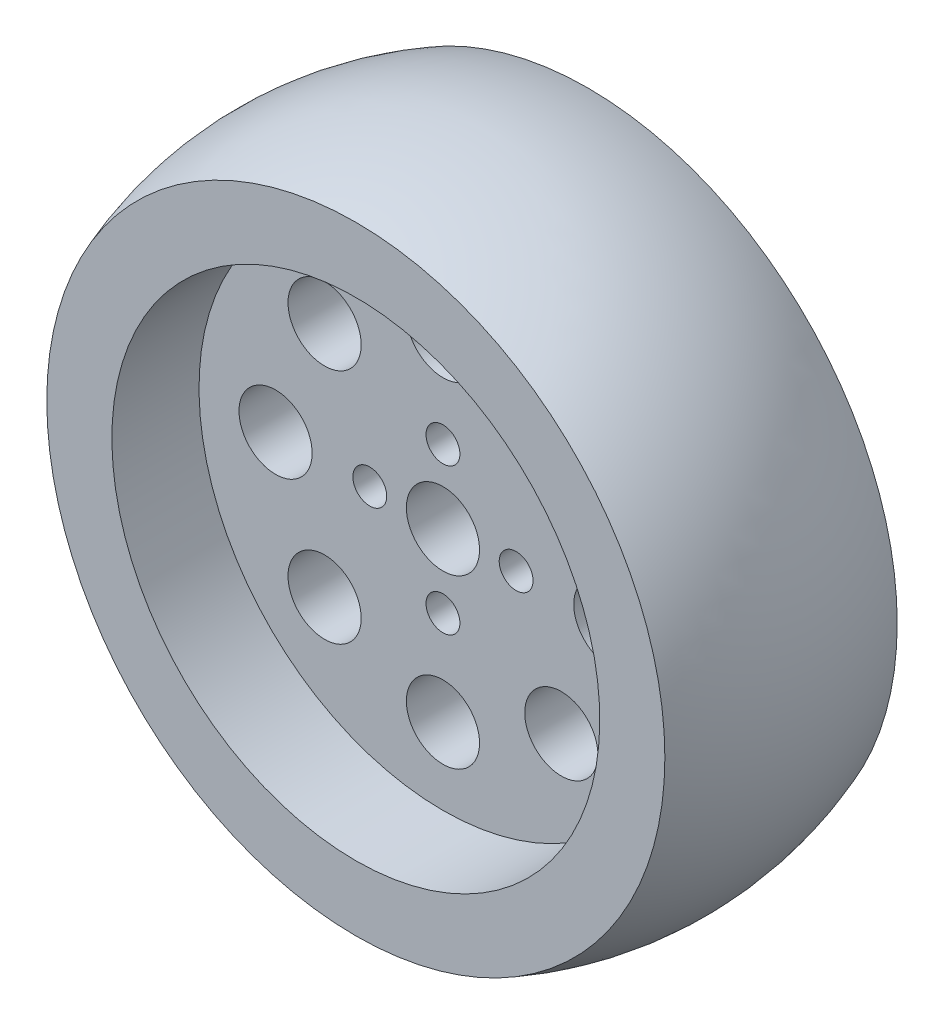
ISO-10303-21;
HEADER;
FILE_DESCRIPTION(('STEP AP214'),'2;1');
FILE_NAME('part.step','',(''),(''),'','','');
FILE_SCHEMA(('AUTOMOTIVE_DESIGN { 1 0 10303 214 1 1 1 1 }'));
ENDSEC;
DATA;
#1=APPLICATION_CONTEXT('core data for automotive mechanical design processes');
#2=APPLICATION_PROTOCOL_DEFINITION('international standard','automotive_design',2000,#1);
#3=PRODUCT_CONTEXT('',#1,'mechanical');
#4=PRODUCT('Part','Part','',(#3));
#5=PRODUCT_RELATED_PRODUCT_CATEGORY('part','',(#4));
#6=PRODUCT_DEFINITION_FORMATION('','',#4);
#7=PRODUCT_DEFINITION_CONTEXT('part definition',#1,'design');
#8=PRODUCT_DEFINITION('design','',#6,#7);
#9=PRODUCT_DEFINITION_SHAPE('','',#8);
#10=(LENGTH_UNIT() NAMED_UNIT(*) SI_UNIT(.MILLI.,.METRE.));
#11=(NAMED_UNIT(*) PLANE_ANGLE_UNIT() SI_UNIT($,.RADIAN.));
#12=(NAMED_UNIT(*) SI_UNIT($,.STERADIAN.) SOLID_ANGLE_UNIT());
#13=UNCERTAINTY_MEASURE_WITH_UNIT(LENGTH_MEASURE(1.E-05),#10,'distance_accuracy_value','');
#14=(GEOMETRIC_REPRESENTATION_CONTEXT(3) GLOBAL_UNCERTAINTY_ASSIGNED_CONTEXT((#13)) GLOBAL_UNIT_ASSIGNED_CONTEXT((#10,
#11,#12)) REPRESENTATION_CONTEXT('',''));
#15=CARTESIAN_POINT('',(0.,0.,0.));
#16=DIRECTION('',(0.,0.,1.));
#17=DIRECTION('',(1.,0.,0.));
#18=AXIS2_PLACEMENT_3D('',#15,#16,#17);
#19=CARTESIAN_POINT('',(0.,0.,-3.175));
#20=DIRECTION('',(0.,0.,1.));
#21=DIRECTION('',(0.,-1.,0.));
#22=AXIS2_PLACEMENT_3D('',#19,#20,#21);
#23=CYLINDRICAL_SURFACE('',#22,4.);
#24=CARTESIAN_POINT('',(0.,0.,3.175));
#25=DIRECTION('',(0.,0.,1.));
#26=DIRECTION('',(0.,-1.,0.));
#27=AXIS2_PLACEMENT_3D('',#24,#25,#26);
#28=CIRCLE('',#27,4.);
#29=CARTESIAN_POINT('',(0.,-4.,3.175));
#30=VERTEX_POINT('',#29);
#31=EDGE_CURVE('E19',#30,#30,#28,.F.);
#32=ORIENTED_EDGE('',*,*,#31,.F.);
#33=EDGE_LOOP('',(#32));
#34=FACE_BOUND('',#33,.T.);
#35=CARTESIAN_POINT('',(0.,0.,-3.175));
#36=DIRECTION('',(0.,0.,1.));
#37=DIRECTION('',(0.,-1.,0.));
#38=AXIS2_PLACEMENT_3D('',#35,#36,#37);
#39=CIRCLE('',#38,4.);
#40=CARTESIAN_POINT('',(0.,-4.,-3.175));
#41=VERTEX_POINT('',#40);
#42=EDGE_CURVE('E78',#41,#41,#39,.F.);
#43=ORIENTED_EDGE('',*,*,#42,.T.);
#44=EDGE_LOOP('',(#43));
#45=FACE_BOUND('',#44,.T.);
#46=ADVANCED_FACE('F15',(#34,#45),#23,.F.);
#47=CARTESIAN_POINT('',(8.,0.,-15.24));
#48=DIRECTION('',(0.,0.,1.));
#49=DIRECTION('',(1.,0.,0.));
#50=AXIS2_PLACEMENT_3D('',#47,#48,#49);
#51=CYLINDRICAL_SURFACE('',#50,1.85);
#52=CARTESIAN_POINT('',(8.,0.,3.175));
#53=DIRECTION('',(0.,0.,1.));
#54=DIRECTION('',(1.,0.,0.));
#55=AXIS2_PLACEMENT_3D('',#52,#53,#54);
#56=CIRCLE('',#55,1.85);
#57=CARTESIAN_POINT('',(9.85,0.,3.175));
#58=VERTEX_POINT('',#57);
#59=EDGE_CURVE('E113',#58,#58,#56,.F.);
#60=ORIENTED_EDGE('',*,*,#59,.F.);
#61=EDGE_LOOP('',(#60));
#62=FACE_BOUND('',#61,.T.);
#63=CARTESIAN_POINT('',(8.,0.,-3.175));
#64=DIRECTION('',(0.,0.,1.));
#65=DIRECTION('',(1.,0.,0.));
#66=AXIS2_PLACEMENT_3D('',#63,#64,#65);
#67=CIRCLE('',#66,1.85);
#68=CARTESIAN_POINT('',(9.85,0.,-3.175));
#69=VERTEX_POINT('',#68);
#70=EDGE_CURVE('E75',#69,#69,#67,.F.);
#71=ORIENTED_EDGE('',*,*,#70,.T.);
#72=EDGE_LOOP('',(#71));
#73=FACE_BOUND('',#72,.T.);
#74=ADVANCED_FACE('F125',(#62,#73),#51,.F.);
#75=CARTESIAN_POINT('',(0.,-8.,-15.24));
#76=DIRECTION('',(0.,0.,1.));
#77=DIRECTION('',(1.,0.,0.));
#78=AXIS2_PLACEMENT_3D('',#75,#76,#77);
#79=CYLINDRICAL_SURFACE('',#78,1.85);
#80=CARTESIAN_POINT('',(0.,-8.,3.175));
#81=DIRECTION('',(0.,0.,1.));
#82=DIRECTION('',(1.,0.,0.));
#83=AXIS2_PLACEMENT_3D('',#80,#81,#82);
#84=CIRCLE('',#83,1.85);
#85=CARTESIAN_POINT('',(1.85,-8.,3.175));
#86=VERTEX_POINT('',#85);
#87=EDGE_CURVE('E111',#86,#86,#84,.F.);
#88=ORIENTED_EDGE('',*,*,#87,.F.);
#89=EDGE_LOOP('',(#88));
#90=FACE_BOUND('',#89,.T.);
#91=CARTESIAN_POINT('',(0.,-8.,-3.175));
#92=DIRECTION('',(0.,0.,1.));
#93=DIRECTION('',(1.,0.,0.));
#94=AXIS2_PLACEMENT_3D('',#91,#92,#93);
#95=CIRCLE('',#94,1.85);
#96=CARTESIAN_POINT('',(1.85,-8.,-3.175));
#97=VERTEX_POINT('',#96);
#98=EDGE_CURVE('E72',#97,#97,#95,.F.);
#99=ORIENTED_EDGE('',*,*,#98,.T.);
#100=EDGE_LOOP('',(#99));
#101=FACE_BOUND('',#100,.T.);
#102=ADVANCED_FACE('F298',(#90,#101),#79,.F.);
#103=CARTESIAN_POINT('',(-8.,0.,-15.24));
#104=DIRECTION('',(0.,0.,1.));
#105=DIRECTION('',(1.,0.,0.));
#106=AXIS2_PLACEMENT_3D('',#103,#104,#105);
#107=CYLINDRICAL_SURFACE('',#106,1.85);
#108=CARTESIAN_POINT('',(-8.,0.,3.175));
#109=DIRECTION('',(0.,0.,1.));
#110=DIRECTION('',(1.,0.,0.));
#111=AXIS2_PLACEMENT_3D('',#108,#109,#110);
#112=CIRCLE('',#111,1.85);
#113=CARTESIAN_POINT('',(-6.15,0.,3.175));
#114=VERTEX_POINT('',#113);
#115=EDGE_CURVE('E108',#114,#114,#112,.F.);
#116=ORIENTED_EDGE('',*,*,#115,.F.);
#117=EDGE_LOOP('',(#116));
#118=FACE_BOUND('',#117,.T.);
#119=CARTESIAN_POINT('',(-8.,0.,-3.175));
#120=DIRECTION('',(0.,0.,1.));
#121=DIRECTION('',(1.,0.,0.));
#122=AXIS2_PLACEMENT_3D('',#119,#120,#121);
#123=CIRCLE('',#122,1.85);
#124=CARTESIAN_POINT('',(-6.15,0.,-3.175));
#125=VERTEX_POINT('',#124);
#126=EDGE_CURVE('E69',#125,#125,#123,.F.);
#127=ORIENTED_EDGE('',*,*,#126,.T.);
#128=EDGE_LOOP('',(#127));
#129=FACE_BOUND('',#128,.T.);
#130=ADVANCED_FACE('F288',(#118,#129),#107,.F.);
#131=CARTESIAN_POINT('',(0.,8.,-15.24));
#132=DIRECTION('',(0.,0.,1.));
#133=DIRECTION('',(1.,0.,0.));
#134=AXIS2_PLACEMENT_3D('',#131,#132,#133);
#135=CYLINDRICAL_SURFACE('',#134,1.85);
#136=CARTESIAN_POINT('',(0.,8.,3.175));
#137=DIRECTION('',(0.,0.,1.));
#138=DIRECTION('',(1.,0.,0.));
#139=AXIS2_PLACEMENT_3D('',#136,#137,#138);
#140=CIRCLE('',#139,1.85);
#141=CARTESIAN_POINT('',(1.85,8.,3.175));
#142=VERTEX_POINT('',#141);
#143=EDGE_CURVE('E105',#142,#142,#140,.F.);
#144=ORIENTED_EDGE('',*,*,#143,.F.);
#145=EDGE_LOOP('',(#144));
#146=FACE_BOUND('',#145,.T.);
#147=CARTESIAN_POINT('',(0.,8.,-3.175));
#148=DIRECTION('',(0.,0.,1.));
#149=DIRECTION('',(1.,0.,0.));
#150=AXIS2_PLACEMENT_3D('',#147,#148,#149);
#151=CIRCLE('',#150,1.85);
#152=CARTESIAN_POINT('',(1.85,8.,-3.175));
#153=VERTEX_POINT('',#152);
#154=EDGE_CURVE('E66',#153,#153,#151,.F.);
#155=ORIENTED_EDGE('',*,*,#154,.T.);
#156=EDGE_LOOP('',(#155));
#157=FACE_BOUND('',#156,.T.);
#158=ADVANCED_FACE('F278',(#146,#157),#135,.F.);
#159=CARTESIAN_POINT('',(0.,-18.3,3.175));
#160=DIRECTION('',(0.,0.,-1.));
#161=DIRECTION('',(0.,1.,0.));
#162=AXIS2_PLACEMENT_3D('',#159,#160,#161);
#163=CYLINDRICAL_SURFACE('',#162,4.);
#164=CARTESIAN_POINT('',(0.,-18.3,3.175));
#165=DIRECTION('',(0.,0.,-1.));
#166=DIRECTION('',(0.,1.,0.));
#167=AXIS2_PLACEMENT_3D('',#164,#165,#166);
#168=CIRCLE('',#167,4.);
#169=CARTESIAN_POINT('',(0.,-14.3,3.175));
#170=VERTEX_POINT('',#169);
#171=EDGE_CURVE('E102',#170,#170,#168,.T.);
#172=ORIENTED_EDGE('',*,*,#171,.F.);
#173=EDGE_LOOP('',(#172));
#174=FACE_BOUND('',#173,.T.);
#175=CARTESIAN_POINT('',(0.,-18.3,-3.175));
#176=DIRECTION('',(0.,0.,-1.));
#177=DIRECTION('',(0.,1.,0.));
#178=AXIS2_PLACEMENT_3D('',#175,#176,#177);
#179=CIRCLE('',#178,4.);
#180=CARTESIAN_POINT('',(0.,-14.3,-3.175));
#181=VERTEX_POINT('',#180);
#182=EDGE_CURVE('E63',#181,#181,#179,.T.);
#183=ORIENTED_EDGE('',*,*,#182,.T.);
#184=EDGE_LOOP('',(#183));
#185=FACE_BOUND('',#184,.T.);
#186=ADVANCED_FACE('F268',(#174,#185),#163,.F.);
#187=CARTESIAN_POINT('',(12.9400540957138,-12.9400540957138,3.175));
#188=DIRECTION('',(0.,0.,-1.));
#189=DIRECTION('',(0.,1.,0.));
#190=AXIS2_PLACEMENT_3D('',#187,#188,#189);
#191=CYLINDRICAL_SURFACE('',#190,4.);
#192=CARTESIAN_POINT('',(12.9400540957138,-12.9400540957138,3.175));
#193=DIRECTION('',(0.,0.,-1.));
#194=DIRECTION('',(0.,1.,0.));
#195=AXIS2_PLACEMENT_3D('',#192,#193,#194);
#196=CIRCLE('',#195,4.);
#197=CARTESIAN_POINT('',(12.9400540957138,-8.9400540957138,3.175));
#198=VERTEX_POINT('',#197);
#199=EDGE_CURVE('E99',#198,#198,#196,.T.);
#200=ORIENTED_EDGE('',*,*,#199,.F.);
#201=EDGE_LOOP('',(#200));
#202=FACE_BOUND('',#201,.T.);
#203=CARTESIAN_POINT('',(12.9400540957138,-12.9400540957138,-3.175));
#204=DIRECTION('',(0.,0.,-1.));
#205=DIRECTION('',(0.,1.,0.));
#206=AXIS2_PLACEMENT_3D('',#203,#204,#205);
#207=CIRCLE('',#206,4.);
#208=CARTESIAN_POINT('',(12.9400540957138,-8.9400540957138,-3.175));
#209=VERTEX_POINT('',#208);
#210=EDGE_CURVE('E60',#209,#209,#207,.T.);
#211=ORIENTED_EDGE('',*,*,#210,.T.);
#212=EDGE_LOOP('',(#211));
#213=FACE_BOUND('',#212,.T.);
#214=ADVANCED_FACE('F258',(#202,#213),#191,.F.);
#215=CARTESIAN_POINT('',(18.3,0.,3.175));
#216=DIRECTION('',(0.,0.,-1.));
#217=DIRECTION('',(0.,1.,0.));
#218=AXIS2_PLACEMENT_3D('',#215,#216,#217);
#219=CYLINDRICAL_SURFACE('',#218,4.);
#220=CARTESIAN_POINT('',(18.3,0.,3.175));
#221=DIRECTION('',(0.,0.,-1.));
#222=DIRECTION('',(0.,1.,0.));
#223=AXIS2_PLACEMENT_3D('',#220,#221,#222);
#224=CIRCLE('',#223,4.);
#225=CARTESIAN_POINT('',(18.3,4.,3.175));
#226=VERTEX_POINT('',#225);
#227=EDGE_CURVE('E96',#226,#226,#224,.T.);
#228=ORIENTED_EDGE('',*,*,#227,.F.);
#229=EDGE_LOOP('',(#228));
#230=FACE_BOUND('',#229,.T.);
#231=CARTESIAN_POINT('',(18.3,0.,-3.175));
#232=DIRECTION('',(0.,0.,-1.));
#233=DIRECTION('',(0.,1.,0.));
#234=AXIS2_PLACEMENT_3D('',#231,#232,#233);
#235=CIRCLE('',#234,4.);
#236=CARTESIAN_POINT('',(18.3,4.,-3.175));
#237=VERTEX_POINT('',#236);
#238=EDGE_CURVE('E57',#237,#237,#235,.T.);
#239=ORIENTED_EDGE('',*,*,#238,.T.);
#240=EDGE_LOOP('',(#239));
#241=FACE_BOUND('',#240,.T.);
#242=ADVANCED_FACE('F248',(#230,#241),#219,.F.);
#243=CARTESIAN_POINT('',(12.9400540957138,12.9400540957138,3.175));
#244=DIRECTION('',(0.,0.,-1.));
#245=DIRECTION('',(0.,1.,0.));
#246=AXIS2_PLACEMENT_3D('',#243,#244,#245);
#247=CYLINDRICAL_SURFACE('',#246,4.);
#248=CARTESIAN_POINT('',(12.9400540957138,12.9400540957138,3.175));
#249=DIRECTION('',(0.,0.,-1.));
#250=DIRECTION('',(0.,1.,0.));
#251=AXIS2_PLACEMENT_3D('',#248,#249,#250);
#252=CIRCLE('',#251,4.);
#253=CARTESIAN_POINT('',(12.9400540957138,16.9400540957138,3.175));
#254=VERTEX_POINT('',#253);
#255=EDGE_CURVE('E93',#254,#254,#252,.T.);
#256=ORIENTED_EDGE('',*,*,#255,.F.);
#257=EDGE_LOOP('',(#256));
#258=FACE_BOUND('',#257,.T.);
#259=CARTESIAN_POINT('',(12.9400540957138,12.9400540957138,-3.175));
#260=DIRECTION('',(0.,0.,-1.));
#261=DIRECTION('',(0.,1.,0.));
#262=AXIS2_PLACEMENT_3D('',#259,#260,#261);
#263=CIRCLE('',#262,4.);
#264=CARTESIAN_POINT('',(12.9400540957138,16.9400540957138,-3.175));
#265=VERTEX_POINT('',#264);
#266=EDGE_CURVE('E54',#265,#265,#263,.T.);
#267=ORIENTED_EDGE('',*,*,#266,.T.);
#268=EDGE_LOOP('',(#267));
#269=FACE_BOUND('',#268,.T.);
#270=ADVANCED_FACE('F238',(#258,#269),#247,.F.);
#271=CARTESIAN_POINT('',(0.,18.3,3.175));
#272=DIRECTION('',(0.,0.,-1.));
#273=DIRECTION('',(0.,1.,0.));
#274=AXIS2_PLACEMENT_3D('',#271,#272,#273);
#275=CYLINDRICAL_SURFACE('',#274,4.);
#276=CARTESIAN_POINT('',(0.,18.3,3.175));
#277=DIRECTION('',(0.,0.,-1.));
#278=DIRECTION('',(0.,1.,0.));
#279=AXIS2_PLACEMENT_3D('',#276,#277,#278);
#280=CIRCLE('',#279,4.);
#281=CARTESIAN_POINT('',(0.,22.3,3.175));
#282=VERTEX_POINT('',#281);
#283=EDGE_CURVE('E90',#282,#282,#280,.T.);
#284=ORIENTED_EDGE('',*,*,#283,.F.);
#285=EDGE_LOOP('',(#284));
#286=FACE_BOUND('',#285,.T.);
#287=CARTESIAN_POINT('',(0.,18.3,-3.175));
#288=DIRECTION('',(0.,0.,-1.));
#289=DIRECTION('',(0.,1.,0.));
#290=AXIS2_PLACEMENT_3D('',#287,#288,#289);
#291=CIRCLE('',#290,4.);
#292=CARTESIAN_POINT('',(0.,22.3,-3.175));
#293=VERTEX_POINT('',#292);
#294=EDGE_CURVE('E51',#293,#293,#291,.T.);
#295=ORIENTED_EDGE('',*,*,#294,.T.);
#296=EDGE_LOOP('',(#295));
#297=FACE_BOUND('',#296,.T.);
#298=ADVANCED_FACE('F228',(#286,#297),#275,.F.);
#299=CARTESIAN_POINT('',(-12.9400540957138,12.9400540957138,3.175));
#300=DIRECTION('',(0.,0.,-1.));
#301=DIRECTION('',(0.,1.,0.));
#302=AXIS2_PLACEMENT_3D('',#299,#300,#301);
#303=CYLINDRICAL_SURFACE('',#302,4.);
#304=CARTESIAN_POINT('',(-12.9400540957138,12.9400540957138,3.175));
#305=DIRECTION('',(0.,0.,-1.));
#306=DIRECTION('',(0.,1.,0.));
#307=AXIS2_PLACEMENT_3D('',#304,#305,#306);
#308=CIRCLE('',#307,4.);
#309=CARTESIAN_POINT('',(-12.9400540957138,16.9400540957138,3.175));
#310=VERTEX_POINT('',#309);
#311=EDGE_CURVE('E87',#310,#310,#308,.T.);
#312=ORIENTED_EDGE('',*,*,#311,.F.);
#313=EDGE_LOOP('',(#312));
#314=FACE_BOUND('',#313,.T.);
#315=CARTESIAN_POINT('',(-12.9400540957138,12.9400540957138,-3.175));
#316=DIRECTION('',(0.,0.,-1.));
#317=DIRECTION('',(0.,1.,0.));
#318=AXIS2_PLACEMENT_3D('',#315,#316,#317);
#319=CIRCLE('',#318,4.);
#320=CARTESIAN_POINT('',(-12.9400540957138,16.9400540957138,-3.175));
#321=VERTEX_POINT('',#320);
#322=EDGE_CURVE('E48',#321,#321,#319,.T.);
#323=ORIENTED_EDGE('',*,*,#322,.T.);
#324=EDGE_LOOP('',(#323));
#325=FACE_BOUND('',#324,.T.);
#326=ADVANCED_FACE('F218',(#314,#325),#303,.F.);
#327=CARTESIAN_POINT('',(-18.3,0.,3.175));
#328=DIRECTION('',(0.,0.,-1.));
#329=DIRECTION('',(0.,1.,0.));
#330=AXIS2_PLACEMENT_3D('',#327,#328,#329);
#331=CYLINDRICAL_SURFACE('',#330,4.);
#332=CARTESIAN_POINT('',(-18.3,0.,3.175));
#333=DIRECTION('',(0.,0.,-1.));
#334=DIRECTION('',(0.,1.,0.));
#335=AXIS2_PLACEMENT_3D('',#332,#333,#334);
#336=CIRCLE('',#335,4.);
#337=CARTESIAN_POINT('',(-18.3,4.00000000000001,3.175));
#338=VERTEX_POINT('',#337);
#339=EDGE_CURVE('E84',#338,#338,#336,.T.);
#340=ORIENTED_EDGE('',*,*,#339,.F.);
#341=EDGE_LOOP('',(#340));
#342=FACE_BOUND('',#341,.T.);
#343=CARTESIAN_POINT('',(-18.3,0.,-3.175));
#344=DIRECTION('',(0.,0.,-1.));
#345=DIRECTION('',(0.,1.,0.));
#346=AXIS2_PLACEMENT_3D('',#343,#344,#345);
#347=CIRCLE('',#346,4.);
#348=CARTESIAN_POINT('',(-18.3,4.00000000000001,-3.175));
#349=VERTEX_POINT('',#348);
#350=EDGE_CURVE('E45',#349,#349,#347,.T.);
#351=ORIENTED_EDGE('',*,*,#350,.T.);
#352=EDGE_LOOP('',(#351));
#353=FACE_BOUND('',#352,.T.);
#354=ADVANCED_FACE('F208',(#342,#353),#331,.F.);
#355=CARTESIAN_POINT('',(-12.9400540957138,-12.9400540957138,3.175));
#356=DIRECTION('',(0.,0.,-1.));
#357=DIRECTION('',(0.,1.,0.));
#358=AXIS2_PLACEMENT_3D('',#355,#356,#357);
#359=CYLINDRICAL_SURFACE('',#358,4.);
#360=CARTESIAN_POINT('',(-12.9400540957138,-12.9400540957138,3.175));
#361=DIRECTION('',(0.,0.,-1.));
#362=DIRECTION('',(0.,1.,0.));
#363=AXIS2_PLACEMENT_3D('',#360,#361,#362);
#364=CIRCLE('',#363,4.);
#365=CARTESIAN_POINT('',(-12.9400540957138,-8.9400540957138,3.175));
#366=VERTEX_POINT('',#365);
#367=EDGE_CURVE('E81',#366,#366,#364,.T.);
#368=ORIENTED_EDGE('',*,*,#367,.F.);
#369=EDGE_LOOP('',(#368));
#370=FACE_BOUND('',#369,.T.);
#371=CARTESIAN_POINT('',(-12.9400540957138,-12.9400540957138,-3.175));
#372=DIRECTION('',(0.,0.,-1.));
#373=DIRECTION('',(0.,1.,0.));
#374=AXIS2_PLACEMENT_3D('',#371,#372,#373);
#375=CIRCLE('',#374,4.);
#376=CARTESIAN_POINT('',(-12.9400540957138,-8.9400540957138,-3.175));
#377=VERTEX_POINT('',#376);
#378=EDGE_CURVE('E42',#377,#377,#375,.T.);
#379=ORIENTED_EDGE('',*,*,#378,.T.);
#380=EDGE_LOOP('',(#379));
#381=FACE_BOUND('',#380,.T.);
#382=ADVANCED_FACE('F198',(#370,#381),#359,.F.);
#383=CARTESIAN_POINT('',(0.,0.,3.175));
#384=DIRECTION('',(0.,0.,1.));
#385=DIRECTION('',(0.,-1.,0.));
#386=AXIS2_PLACEMENT_3D('',#383,#384,#385);
#387=PLANE('',#386);
#388=ORIENTED_EDGE('',*,*,#367,.T.);
#389=EDGE_LOOP('',(#388));
#390=FACE_BOUND('',#389,.T.);
#391=ORIENTED_EDGE('',*,*,#339,.T.);
#392=EDGE_LOOP('',(#391));
#393=FACE_BOUND('',#392,.T.);
#394=ORIENTED_EDGE('',*,*,#311,.T.);
#395=EDGE_LOOP('',(#394));
#396=FACE_BOUND('',#395,.T.);
#397=ORIENTED_EDGE('',*,*,#283,.T.);
#398=EDGE_LOOP('',(#397));
#399=FACE_BOUND('',#398,.T.);
#400=ORIENTED_EDGE('',*,*,#255,.T.);
#401=EDGE_LOOP('',(#400));
#402=FACE_BOUND('',#401,.T.);
#403=ORIENTED_EDGE('',*,*,#227,.T.);
#404=EDGE_LOOP('',(#403));
#405=FACE_BOUND('',#404,.T.);
#406=ORIENTED_EDGE('',*,*,#199,.T.);
#407=EDGE_LOOP('',(#406));
#408=FACE_BOUND('',#407,.T.);
#409=ORIENTED_EDGE('',*,*,#171,.T.);
#410=EDGE_LOOP('',(#409));
#411=FACE_BOUND('',#410,.T.);
#412=ORIENTED_EDGE('',*,*,#143,.T.);
#413=EDGE_LOOP('',(#412));
#414=FACE_BOUND('',#413,.T.);
#415=ORIENTED_EDGE('',*,*,#115,.T.);
#416=EDGE_LOOP('',(#415));
#417=FACE_BOUND('',#416,.T.);
#418=ORIENTED_EDGE('',*,*,#87,.T.);
#419=EDGE_LOOP('',(#418));
#420=FACE_BOUND('',#419,.T.);
#421=ORIENTED_EDGE('',*,*,#59,.T.);
#422=EDGE_LOOP('',(#421));
#423=FACE_BOUND('',#422,.T.);
#424=ORIENTED_EDGE('',*,*,#31,.T.);
#425=EDGE_LOOP('',(#424));
#426=FACE_BOUND('',#425,.T.);
#427=CARTESIAN_POINT('',(0.,0.,3.175));
#428=DIRECTION('',(0.,0.,1.));
#429=DIRECTION('',(0.,-1.,0.));
#430=AXIS2_PLACEMENT_3D('',#427,#428,#429);
#431=CIRCLE('',#430,26.67);
#432=CARTESIAN_POINT('',(0.,-26.67,3.175));
#433=VERTEX_POINT('',#432);
#434=EDGE_CURVE('E39',#433,#433,#431,.T.);
#435=ORIENTED_EDGE('',*,*,#434,.T.);
#436=EDGE_LOOP('',(#435));
#437=FACE_BOUND('',#436,.T.);
#438=ADVANCED_FACE('F120',(#390,#393,#396,#399,#402,#405,#408,#411,#414,#417,#420,#423,#426,
#437),#387,.T.);
#439=CARTESIAN_POINT('',(0.,0.,-3.175));
#440=DIRECTION('',(0.,0.,1.));
#441=DIRECTION('',(0.,-1.,0.));
#442=AXIS2_PLACEMENT_3D('',#439,#440,#441);
#443=PLANE('',#442);
#444=ORIENTED_EDGE('',*,*,#378,.F.);
#445=EDGE_LOOP('',(#444));
#446=FACE_BOUND('',#445,.T.);
#447=ORIENTED_EDGE('',*,*,#350,.F.);
#448=EDGE_LOOP('',(#447));
#449=FACE_BOUND('',#448,.T.);
#450=ORIENTED_EDGE('',*,*,#322,.F.);
#451=EDGE_LOOP('',(#450));
#452=FACE_BOUND('',#451,.T.);
#453=ORIENTED_EDGE('',*,*,#294,.F.);
#454=EDGE_LOOP('',(#453));
#455=FACE_BOUND('',#454,.T.);
#456=ORIENTED_EDGE('',*,*,#266,.F.);
#457=EDGE_LOOP('',(#456));
#458=FACE_BOUND('',#457,.T.);
#459=ORIENTED_EDGE('',*,*,#238,.F.);
#460=EDGE_LOOP('',(#459));
#461=FACE_BOUND('',#460,.T.);
#462=ORIENTED_EDGE('',*,*,#210,.F.);
#463=EDGE_LOOP('',(#462));
#464=FACE_BOUND('',#463,.T.);
#465=ORIENTED_EDGE('',*,*,#182,.F.);
#466=EDGE_LOOP('',(#465));
#467=FACE_BOUND('',#466,.T.);
#468=ORIENTED_EDGE('',*,*,#154,.F.);
#469=EDGE_LOOP('',(#468));
#470=FACE_BOUND('',#469,.T.);
#471=ORIENTED_EDGE('',*,*,#126,.F.);
#472=EDGE_LOOP('',(#471));
#473=FACE_BOUND('',#472,.T.);
#474=ORIENTED_EDGE('',*,*,#98,.F.);
#475=EDGE_LOOP('',(#474));
#476=FACE_BOUND('',#475,.T.);
#477=ORIENTED_EDGE('',*,*,#70,.F.);
#478=EDGE_LOOP('',(#477));
#479=FACE_BOUND('',#478,.T.);
#480=ORIENTED_EDGE('',*,*,#42,.F.);
#481=EDGE_LOOP('',(#480));
#482=FACE_BOUND('',#481,.T.);
#483=CARTESIAN_POINT('',(0.,0.,-3.175));
#484=DIRECTION('',(0.,0.,1.));
#485=DIRECTION('',(0.,-1.,0.));
#486=AXIS2_PLACEMENT_3D('',#483,#484,#485);
#487=CIRCLE('',#486,26.67);
#488=CARTESIAN_POINT('',(0.,-26.67,-3.175));
#489=VERTEX_POINT('',#488);
#490=EDGE_CURVE('E36',#489,#489,#487,.F.);
#491=ORIENTED_EDGE('',*,*,#490,.T.);
#492=EDGE_LOOP('',(#491));
#493=FACE_BOUND('',#492,.T.);
#494=ADVANCED_FACE('F128',(#446,#449,#452,#455,#458,#461,#464,#467,#470,#473,#476,#479,#482,
#493),#443,.F.);
#495=CARTESIAN_POINT('',(0.,0.,-13.97));
#496=DIRECTION('',(0.,0.,1.));
#497=DIRECTION('',(0.,-1.,0.));
#498=AXIS2_PLACEMENT_3D('',#495,#496,#497);
#499=CYLINDRICAL_SURFACE('',#498,26.67);
#500=ORIENTED_EDGE('',*,*,#434,.F.);
#501=EDGE_LOOP('',(#500));
#502=FACE_BOUND('',#501,.T.);
#503=CARTESIAN_POINT('',(0.,0.,12.7));
#504=DIRECTION('',(0.,0.,1.));
#505=DIRECTION('',(0.,-1.,0.));
#506=AXIS2_PLACEMENT_3D('',#503,#504,#505);
#507=CIRCLE('',#506,26.67);
#508=CARTESIAN_POINT('',(0.,-26.67,12.7));
#509=VERTEX_POINT('',#508);
#510=EDGE_CURVE('E33',#509,#509,#507,.F.);
#511=ORIENTED_EDGE('',*,*,#510,.F.);
#512=EDGE_LOOP('',(#511));
#513=FACE_BOUND('',#512,.T.);
#514=ADVANCED_FACE('F131',(#502,#513),#499,.F.);
#515=CARTESIAN_POINT('',(0.,0.,-13.97));
#516=DIRECTION('',(0.,0.,1.));
#517=DIRECTION('',(0.,-1.,0.));
#518=AXIS2_PLACEMENT_3D('',#515,#516,#517);
#519=CYLINDRICAL_SURFACE('',#518,26.67);
#520=CARTESIAN_POINT('',(0.,0.,-12.7));
#521=DIRECTION('',(0.,0.,1.));
#522=DIRECTION('',(0.,-1.,0.));
#523=AXIS2_PLACEMENT_3D('',#520,#521,#522);
#524=CIRCLE('',#523,26.67);
#525=CARTESIAN_POINT('',(0.,-26.67,-12.7));
#526=VERTEX_POINT('',#525);
#527=EDGE_CURVE('E28',#526,#526,#524,.F.);
#528=ORIENTED_EDGE('',*,*,#527,.T.);
#529=EDGE_LOOP('',(#528));
#530=FACE_BOUND('',#529,.T.);
#531=ORIENTED_EDGE('',*,*,#490,.F.);
#532=EDGE_LOOP('',(#531));
#533=FACE_BOUND('',#532,.T.);
#534=ADVANCED_FACE('F136',(#530,#533),#519,.F.);
#535=CARTESIAN_POINT('',(0.,0.,12.7));
#536=DIRECTION('',(0.,0.,1.));
#537=DIRECTION('',(0.,-1.,0.));
#538=AXIS2_PLACEMENT_3D('',#535,#536,#537);
#539=PLANE('',#538);
#540=ORIENTED_EDGE('',*,*,#510,.T.);
#541=EDGE_LOOP('',(#540));
#542=FACE_BOUND('',#541,.T.);
#543=CARTESIAN_POINT('',(0.,0.,12.7));
#544=DIRECTION('',(0.,0.,1.));
#545=DIRECTION('',(1.,0.,0.));
#546=AXIS2_PLACEMENT_3D('',#543,#544,#545);
#547=CIRCLE('',#546,33.7854568026025);
#548=CARTESIAN_POINT('',(33.7854568026025,0.,12.7));
#549=VERTEX_POINT('',#548);
#550=EDGE_CURVE('E23',#549,#549,#547,.T.);
#551=ORIENTED_EDGE('',*,*,#550,.T.);
#552=EDGE_LOOP('',(#551));
#553=FACE_BOUND('',#552,.T.);
#554=ADVANCED_FACE('F138',(#542,#553),#539,.T.);
#555=CARTESIAN_POINT('',(0.,0.,-12.7));
#556=DIRECTION('',(0.,0.,1.));
#557=DIRECTION('',(0.,-1.,0.));
#558=AXIS2_PLACEMENT_3D('',#555,#556,#557);
#559=PLANE('',#558);
#560=ORIENTED_EDGE('',*,*,#527,.F.);
#561=EDGE_LOOP('',(#560));
#562=FACE_BOUND('',#561,.T.);
#563=CARTESIAN_POINT('',(0.,0.,-12.7));
#564=DIRECTION('',(0.,0.,1.));
#565=DIRECTION('',(1.,0.,0.));
#566=AXIS2_PLACEMENT_3D('',#563,#564,#565);
#567=CIRCLE('',#566,33.7854568026025);
#568=CARTESIAN_POINT('',(33.7854568026025,0.,-12.7));
#569=VERTEX_POINT('',#568);
#570=EDGE_CURVE('E9',#569,#569,#567,.F.);
#571=ORIENTED_EDGE('',*,*,#570,.T.);
#572=EDGE_LOOP('',(#571));
#573=FACE_BOUND('',#572,.T.);
#574=ADVANCED_FACE('F146',(#562,#573),#559,.F.);
#575=CARTESIAN_POINT('',(0.,0.,0.));
#576=DIRECTION('',(0.,0.,1.));
#577=DIRECTION('',(1.,0.,0.));
#578=AXIS2_PLACEMENT_3D('',#575,#576,#577);
#579=DEGENERATE_TOROIDAL_SURFACE('',#578,0.100000000000257,35.9999999999998,.T.);
#580=ORIENTED_EDGE('',*,*,#570,.F.);
#581=EDGE_LOOP('',(#580));
#582=FACE_BOUND('',#581,.T.);
#583=ORIENTED_EDGE('',*,*,#550,.F.);
#584=EDGE_LOOP('',(#583));
#585=FACE_BOUND('',#584,.T.);
#586=ADVANCED_FACE('F17',(#582,#585),#579,.T.);
#587=CLOSED_SHELL('',(#46,#74,#102,#130,#158,#186,#214,#242,#270,#298,#326,#354,#382,#438,#494,
#514,#534,#554,#574,#586));
#588=MANIFOLD_SOLID_BREP('B1',#587);
#589=ADVANCED_BREP_SHAPE_REPRESENTATION('',(#18,#588),#14);
#590=SHAPE_DEFINITION_REPRESENTATION(#9,#589);
ENDSEC;
END-ISO-10303-21;
